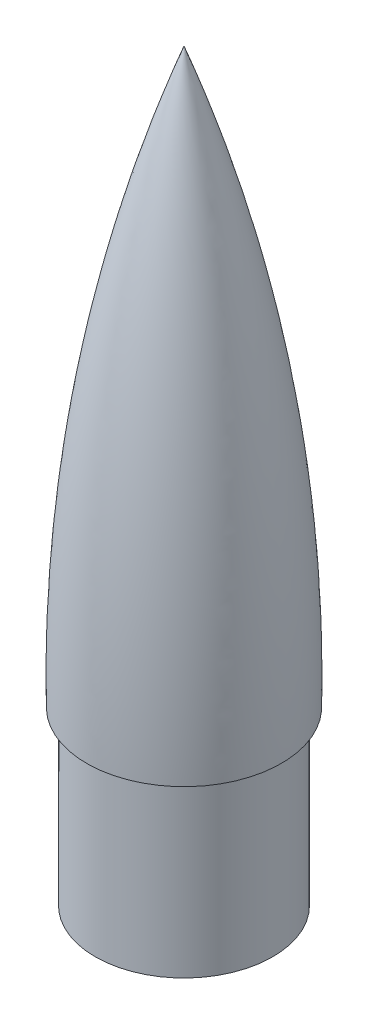
ISO-10303-21;
HEADER;
FILE_DESCRIPTION(('STEP AP214'),'2;1');
FILE_NAME('part.step','',(''),(''),'','','');
FILE_SCHEMA(('AUTOMOTIVE_DESIGN { 1 0 10303 214 1 1 1 1 }'));
ENDSEC;
DATA;
#1=APPLICATION_CONTEXT('core data for automotive mechanical design processes');
#2=APPLICATION_PROTOCOL_DEFINITION('international standard','automotive_design',2000,#1);
#3=PRODUCT_CONTEXT('',#1,'mechanical');
#4=PRODUCT('Part','Part','',(#3));
#5=PRODUCT_RELATED_PRODUCT_CATEGORY('part','',(#4));
#6=PRODUCT_DEFINITION_FORMATION('','',#4);
#7=PRODUCT_DEFINITION_CONTEXT('part definition',#1,'design');
#8=PRODUCT_DEFINITION('design','',#6,#7);
#9=PRODUCT_DEFINITION_SHAPE('','',#8);
#10=(LENGTH_UNIT() NAMED_UNIT(*) SI_UNIT(.MILLI.,.METRE.));
#11=(NAMED_UNIT(*) PLANE_ANGLE_UNIT() SI_UNIT($,.RADIAN.));
#12=(NAMED_UNIT(*) SI_UNIT($,.STERADIAN.) SOLID_ANGLE_UNIT());
#13=UNCERTAINTY_MEASURE_WITH_UNIT(LENGTH_MEASURE(1.E-05),#10,'distance_accuracy_value','');
#14=(GEOMETRIC_REPRESENTATION_CONTEXT(3) GLOBAL_UNCERTAINTY_ASSIGNED_CONTEXT((#13)) GLOBAL_UNIT_ASSIGNED_CONTEXT((#10,
#11,#12)) REPRESENTATION_CONTEXT('',''));
#15=CARTESIAN_POINT('',(0.,0.,0.));
#16=DIRECTION('',(0.,0.,1.));
#17=DIRECTION('',(1.,0.,0.));
#18=AXIS2_PLACEMENT_3D('',#15,#16,#17);
#19=CARTESIAN_POINT('',(0.,0.,0.));
#20=DIRECTION('',(0.,1.,0.));
#21=DIRECTION('',(0.,0.,1.));
#22=AXIS2_PLACEMENT_3D('',#19,#20,#21);
#23=PLANE('',#22);
#24=CARTESIAN_POINT('',(0.,0.,0.));
#25=DIRECTION('',(0.,1.,0.));
#26=DIRECTION('',(0.,0.,1.));
#27=AXIS2_PLACEMENT_3D('',#24,#25,#26);
#28=CIRCLE('',#27,15.5);
#29=CARTESIAN_POINT('',(0.,0.,15.5));
#30=VERTEX_POINT('',#29);
#31=EDGE_CURVE('E51',#30,#30,#28,.T.);
#32=ORIENTED_EDGE('',*,*,#31,.F.);
#33=EDGE_LOOP('',(#32));
#34=FACE_BOUND('',#33,.T.);
#35=CARTESIAN_POINT('',(0.,0.,0.));
#36=DIRECTION('',(0.,1.,0.));
#37=DIRECTION('',(0.,0.,1.));
#38=AXIS2_PLACEMENT_3D('',#35,#36,#37);
#39=CIRCLE('',#38,14.5);
#40=CARTESIAN_POINT('',(0.,0.,14.5));
#41=VERTEX_POINT('',#40);
#42=EDGE_CURVE('E101',#41,#41,#39,.T.);
#43=ORIENTED_EDGE('',*,*,#42,.T.);
#44=EDGE_LOOP('',(#43));
#45=FACE_BOUND('',#44,.T.);
#46=ADVANCED_FACE('F37',(#34,#45),#23,.F.);
#47=CARTESIAN_POINT('',(0.,30.,0.));
#48=DIRECTION('',(0.,-1.,0.));
#49=DIRECTION('',(0.,0.,-1.));
#50=AXIS2_PLACEMENT_3D('',#47,#48,#49);
#51=CYLINDRICAL_SURFACE('',#50,15.5);
#52=CARTESIAN_POINT('',(0.,3.3,-15.5));
#53=CARTESIAN_POINT('',(-0.0449042752623699,3.29999801891395,-15.4999997239942));
#54=CARTESIAN_POINT('',(-0.0898403483075212,3.29620656261025,-15.4998027755589));
#55=CARTESIAN_POINT('',(-0.178472732249487,3.28113553683103,-15.4990360430875));
#56=CARTESIAN_POINT('',(-0.222167521340504,3.26984715712822,-15.4984658203985));
#57=CARTESIAN_POINT('',(-0.307020594369712,3.24010646455045,-15.4970170753138));
#58=CARTESIAN_POINT('',(-0.348180163813976,3.22165781758596,-15.4961387107025));
#59=CARTESIAN_POINT('',(-0.426807194446856,3.17812594945897,-15.4941725912758));
#60=CARTESIAN_POINT('',(-0.464275521323446,3.15304428901104,-15.4930848857335));
#61=CARTESIAN_POINT('',(-0.534507566457324,3.09692864874147,-15.490821135761));
#62=CARTESIAN_POINT('',(-0.567266854744877,3.06588912740107,-15.4896450097136));
#63=CARTESIAN_POINT('',(-0.62711313599514,2.99874998409467,-15.487337678088));
#64=CARTESIAN_POINT('',(-0.654199896636211,2.9626501549819,-15.4862064743512));
#65=CARTESIAN_POINT('',(-0.701944671799145,2.88639160492156,-15.4841159636226));
#66=CARTESIAN_POINT('',(-0.722599191861546,2.84623069333867,-15.483156750188));
#67=CARTESIAN_POINT('',(-0.756870770762998,2.76300541006643,-15.4815193926693));
#68=CARTESIAN_POINT('',(-0.770487885596111,2.71994106148175,-15.4808412463489));
#69=CARTESIAN_POINT('',(-0.790286315909607,2.63217240539612,-15.4798432404336));
#70=CARTESIAN_POINT('',(-0.796474309783027,2.58746960809226,-15.4795230590647));
#71=CARTESIAN_POINT('',(-0.80125945042522,2.49765871558006,-15.4792761236371));
#72=CARTESIAN_POINT('',(-0.79985666013293,2.45255062373532,-15.4793493663162));
#73=CARTESIAN_POINT('',(-0.789505612741981,2.36325500240683,-15.4798807204727));
#74=CARTESIAN_POINT('',(-0.780564572653492,2.31906663384137,-15.4803384638331));
#75=CARTESIAN_POINT('',(-0.755402014215898,2.23281882274256,-15.4815866482603));
#76=CARTESIAN_POINT('',(-0.739180463599121,2.19075938964571,-15.4823770908015));
#77=CARTESIAN_POINT('',(-0.699909118045855,2.10994011951936,-15.4842020094838));
#78=CARTESIAN_POINT('',(-0.676856034723451,2.07118188312785,-15.4852366030989));
#79=CARTESIAN_POINT('',(-0.624578410248747,1.99808271653519,-15.4874330975801));
#80=CARTESIAN_POINT('',(-0.595353822529938,1.96374181966781,-15.4885949994068));
#81=CARTESIAN_POINT('',(-0.53152205047322,1.90041014051711,-15.4909167908476));
#82=CARTESIAN_POINT('',(-0.496908616884315,1.8714256563124,-15.4920766765243));
#83=CARTESIAN_POINT('',(-0.423303657606504,1.8196781026217,-15.4942624000891));
#84=CARTESIAN_POINT('',(-0.38431213079421,1.79691503473209,-15.4952882379428));
#85=CARTESIAN_POINT('',(-0.303054111378361,1.75825706924629,-15.4970903033857));
#86=CARTESIAN_POINT('',(-0.260787512990015,1.74236239360828,-15.4978665229081));
#87=CARTESIAN_POINT('',(-0.174180786778669,1.71789653134146,-15.4990817555668));
#88=CARTESIAN_POINT('',(-0.129840675494137,1.70932528631103,-15.4995207713922));
#89=CARTESIAN_POINT('',(-0.0404002485712565,1.69975735869128,-15.5000117739791));
#90=CARTESIAN_POINT('',(0.00469913287560576,1.69875196515422,-15.5000642058328));
#91=CARTESIAN_POINT('',(0.094425954741791,1.70432154405012,-15.4997773133914));
#92=CARTESIAN_POINT('',(0.139053396825536,1.71089648973995,-15.4994379904783));
#93=CARTESIAN_POINT('',(0.226545105968455,1.73143289831666,-15.4984060915558));
#94=CARTESIAN_POINT('',(0.26941030957934,1.74539038155772,-15.4977137058764));
#95=CARTESIAN_POINT('',(0.352189612423911,1.7802916279918,-15.4960536278545));
#96=CARTESIAN_POINT('',(0.392103693546645,1.80123543405535,-15.4950859338226));
#97=CARTESIAN_POINT('',(0.467887722131942,1.84953709563402,-15.4929829761655));
#98=CARTESIAN_POINT('',(0.503753945195229,1.87690078791262,-15.4918475604028));
#99=CARTESIAN_POINT('',(0.570386694147288,1.93725694310167,-15.4895375262628));
#100=CARTESIAN_POINT('',(0.601153185286682,1.9702494443635,-15.4883629076183));
#101=CARTESIAN_POINT('',(0.656742470503243,2.04096416773664,-15.4861055870035));
#102=CARTESIAN_POINT('',(0.681559626761376,2.07869082495514,-15.4850229728421));
#103=CARTESIAN_POINT('',(0.724507238054344,2.1577805431865,-15.4830731257882));
#104=CARTESIAN_POINT('',(0.742637723614283,2.19914358759795,-15.4822058919125));
#105=CARTESIAN_POINT('',(0.771687513191092,2.28431108264928,-15.4807852277407));
#106=CARTESIAN_POINT('',(0.782610405979214,2.32811430648612,-15.4802316412942));
#107=CARTESIAN_POINT('',(0.796946684848884,2.41693590077994,-15.4795002600012));
#108=CARTESIAN_POINT('',(0.800360117271015,2.46195426373661,-15.4793224628356));
#109=CARTESIAN_POINT('',(0.799580142191041,2.55187211883627,-15.4793627671014));
#110=CARTESIAN_POINT('',(0.795395603100788,2.59677168838399,-15.4795804069757));
#111=CARTESIAN_POINT('',(0.779556807314405,2.68522991609265,-15.480386080533));
#112=CARTESIAN_POINT('',(0.767902536454407,2.72878857171083,-15.4809741149184));
#113=CARTESIAN_POINT('',(0.73745693678844,2.81333028639914,-15.4824541974682));
#114=CARTESIAN_POINT('',(0.718665565518158,2.85431333014322,-15.4833462474414));
#115=CARTESIAN_POINT('',(0.674480662380689,2.93254344697281,-15.485333795324));
#116=CARTESIAN_POINT('',(0.649087329394521,2.96979063255248,-15.4864292871044));
#117=CARTESIAN_POINT('',(0.592387391523107,3.03953613305957,-15.4887017136426));
#118=CARTESIAN_POINT('',(0.561074565543049,3.07202938752728,-15.48987873325));
#119=CARTESIAN_POINT('',(0.493429328939067,3.13130827767203,-15.4921809390081));
#120=CARTESIAN_POINT('',(0.457095686135381,3.15809250815846,-15.4933061123443));
#121=CARTESIAN_POINT('',(0.380410190490184,3.2052063990287,-15.4953786597807));
#122=CARTESIAN_POINT('',(0.340054393783313,3.225529640749,-15.4963258566908));
#123=CARTESIAN_POINT('',(0.256528626218081,3.25908772013562,-15.4979331071516));
#124=CARTESIAN_POINT('',(0.213362043947144,3.27233092206002,-15.4985934993555));
#125=CARTESIAN_POINT('',(0.141606449590593,3.28788296500577,-15.4993782433081));
#126=CARTESIAN_POINT('',(0.113482103568098,3.29242104331927,-15.4996103760488));
#127=CARTESIAN_POINT('',(0.0569094294798187,3.29848018726219,-15.4999213417933));
#128=CARTESIAN_POINT('',(0.0284611017098812,3.3000012556464,-15.5000001749372));
#129=CARTESIAN_POINT('',(0.,3.3,-15.5));
#130=B_SPLINE_CURVE_WITH_KNOTS('',3,(#52,#53,#54,#55,#56,#57,#58,#59,#60,#61,#62,#63,#64,#65,
#66,#67,#68,#69,#70,#71,#72,#73,#74,#75,#76,#77,#78,#79,#80,#81,#82,#83,#84,#85,#86,#87,#88,#89,
#90,#91,#92,#93,#94,#95,#96,#97,#98,#99,#100,#101,#102,#103,#104,#105,#106,#107,#108,#109,#110,
#111,#112,#113,#114,#115,#116,#117,#118,#119,#120,#121,#122,#123,#124,#125,#126,#127,#128,#129),
.UNSPECIFIED.,.T.,.F.,(4,2,2,2,2,2,2,2,2,2,2,2,2,2,2,2,2,2,2,2,2,2,2,2,2,2,2,2,2,2,2,2,2,2,2,2,
2,2,4),(0.,0.134608931421981,0.269376333020869,0.404074827289342,0.538741655838066,
0.67353435288328,0.808332569361912,0.943203890764681,1.07807413902912,1.21282305496098,
1.34757085362482,1.48218979301524,1.61680932905097,1.75149377029381,1.88617922782185,
2.02102205491275,2.15586491660348,2.29071213553481,2.42555827909976,2.56024914368646,
2.6949395330907,2.82955738990399,2.96417607279451,3.09891762441979,3.23366009413111,
3.36852975067331,3.50339879151877,3.63820062822101,3.7730016330641,3.90764539825051,
4.04228941874491,4.17693424035671,4.31157500632593,4.44635806775697,4.58117426580554,
4.71612398135918,4.8509139149556,4.93623144795243,5.02154890304718),.UNSPECIFIED.);
#131=CARTESIAN_POINT('',(0.,3.3,-15.5));
#132=VERTEX_POINT('',#131);
#133=EDGE_CURVE('E120',#132,#132,#130,.T.);
#134=ORIENTED_EDGE('',*,*,#133,.T.);
#135=EDGE_LOOP('',(#134));
#136=FACE_BOUND('',#135,.T.);
#137=CARTESIAN_POINT('',(0.,30.,0.));
#138=DIRECTION('',(0.,1.,0.));
#139=DIRECTION('',(0.,0.,1.));
#140=AXIS2_PLACEMENT_3D('',#137,#138,#139);
#141=CIRCLE('',#140,15.5);
#142=CARTESIAN_POINT('',(0.,30.,15.5));
#143=VERTEX_POINT('',#142);
#144=EDGE_CURVE('E11',#143,#143,#141,.T.);
#145=ORIENTED_EDGE('',*,*,#144,.F.);
#146=EDGE_LOOP('',(#145));
#147=FACE_BOUND('',#146,.T.);
#148=ORIENTED_EDGE('',*,*,#31,.T.);
#149=EDGE_LOOP('',(#148));
#150=FACE_BOUND('',#149,.T.);
#151=ADVANCED_FACE('F39',(#136,#147,#150),#51,.T.);
#152=CARTESIAN_POINT('',(0.,30.,0.));
#153=DIRECTION('',(0.,-1.,0.));
#154=DIRECTION('',(0.,0.,-1.));
#155=AXIS2_PLACEMENT_3D('',#152,#153,#154);
#156=CYLINDRICAL_SURFACE('',#155,14.5);
#157=CARTESIAN_POINT('',(0.,3.3,-14.5));
#158=CARTESIAN_POINT('',(-0.0448997038534462,3.29999802069897,-14.4999997054633));
#159=CARTESIAN_POINT('',(-0.0898310933597828,3.29620733320394,-14.4997892176745));
#160=CARTESIAN_POINT('',(-0.178453925894953,3.28113953932199,-14.4989697758064));
#161=CARTESIAN_POINT('',(-0.222143852120782,3.26985365367248,-14.4983603544609));
#162=CARTESIAN_POINT('',(-0.306987175841121,3.24011997414036,-14.4968120084593));
#163=CARTESIAN_POINT('',(-0.34814187088615,3.22167587977017,-14.4958732540336));
#164=CARTESIAN_POINT('',(-0.426760114893581,3.17815515016863,-14.4937719130159));
#165=CARTESIAN_POINT('',(-0.464224522328655,3.15308006253218,-14.4926093786688));
#166=CARTESIAN_POINT('',(-0.534454630469344,3.09697591691933,-14.4901896572389));
#167=CARTESIAN_POINT('',(-0.567215343026485,3.06594061861212,-14.4889323717977));
#168=CARTESIAN_POINT('',(-0.627065527746397,2.99880968155813,-14.4864656962933));
#169=CARTESIAN_POINT('',(-0.65415476620816,2.96271383438666,-14.4852563082055));
#170=CARTESIAN_POINT('',(-0.701907560631343,2.88645927309085,-14.483021082221));
#171=CARTESIAN_POINT('',(-0.722567103427851,2.84629804215199,-14.4819953591298));
#172=CARTESIAN_POINT('',(-0.756848344699112,2.76307042753112,-14.4802443666613));
#173=CARTESIAN_POINT('',(-0.770470105183677,2.72000406944994,-14.4795190946369));
#174=CARTESIAN_POINT('',(-0.79027561438821,2.63223562306461,-14.478451704381));
#175=CARTESIAN_POINT('',(-0.796466994599522,2.58753526171234,-14.4781091930541));
#176=CARTESIAN_POINT('',(-0.80125954394121,2.49772849402953,-14.477844770016));
#177=CARTESIAN_POINT('',(-0.799860783047359,2.45262209144624,-14.4779228544273));
#178=CARTESIAN_POINT('',(-0.789519102046292,2.36333556774315,-14.4784904521653));
#179=CARTESIAN_POINT('',(-0.780584432067669,2.31915448778887,-14.4789795155601));
#180=CARTESIAN_POINT('',(-0.755437345076214,2.23292018345644,-14.4803132434664));
#181=CARTESIAN_POINT('',(-0.739224892327705,2.19086696952776,-14.4811579097239));
#182=CARTESIAN_POINT('',(-0.699973051289722,2.11005558146207,-14.4831081655122));
#183=CARTESIAN_POINT('',(-0.676929908948474,2.07129923435033,-14.4842138984535));
#184=CARTESIAN_POINT('',(-0.624673527490567,1.99820170909413,-14.4865615225834));
#185=CARTESIAN_POINT('',(-0.595460234834343,1.96386056926542,-14.4878034149536));
#186=CARTESIAN_POINT('',(-0.531646289266423,1.90052026619628,-14.4902853915673));
#187=CARTESIAN_POINT('',(-0.497038493771808,1.87152829827892,-14.4915254711813));
#188=CARTESIAN_POINT('',(-0.423443008257824,1.81976478097019,-14.4938624649047));
#189=CARTESIAN_POINT('',(-0.384455317000379,1.79699323333716,-14.4949593789736));
#190=CARTESIAN_POINT('',(-0.303202487620869,1.75831761541109,-14.4968864874696));
#191=CARTESIAN_POINT('',(-0.260937225781699,1.74241380450065,-14.4977166718225));
#192=CARTESIAN_POINT('',(-0.174330909206823,1.71792985375799,-14.4990166209283));
#193=CARTESIAN_POINT('',(-0.129989873380149,1.70934964722589,-14.4994863889638));
#194=CARTESIAN_POINT('',(-0.0405531386738182,1.69976535237016,-14.5000121426619));
#195=CARTESIAN_POINT('',(0.00454149079584767,1.6987513132327,-14.5000686718029));
#196=CARTESIAN_POINT('',(0.0942602425320833,1.70430215745221,-14.4997630211139));
#197=CARTESIAN_POINT('',(0.138884366698806,1.7108670101897,-14.4994008429753));
#198=CARTESIAN_POINT('',(0.226367452114782,1.7313810488445,-14.4982989124912));
#199=CARTESIAN_POINT('',(0.269227483951207,1.7453256827447,-14.4975593929084));
#200=CARTESIAN_POINT('',(0.351998750332866,1.78019882887385,-14.4957860154144));
#201=CARTESIAN_POINT('',(0.391909964189538,1.80112739009553,-14.4947521554384));
#202=CARTESIAN_POINT('',(0.467696305560378,1.84939972644331,-14.4925049943357));
#203=CARTESIAN_POINT('',(0.503567184777285,1.87675016251063,-14.4912915073813));
#204=CARTESIAN_POINT('',(0.570211879204188,1.9370801524293,-14.4888223385494));
#205=CARTESIAN_POINT('',(0.600985654967705,1.97005974984072,-14.4875666563453));
#206=CARTESIAN_POINT('',(0.656596169755032,2.04075474863939,-14.4851530634213));
#207=CARTESIAN_POINT('',(0.68142646383324,2.07847522393654,-14.4839952597098));
#208=CARTESIAN_POINT('',(0.724401112326177,2.15755564965193,-14.4819096774477));
#209=CARTESIAN_POINT('',(0.742545500554872,2.1989155816623,-14.4809818977337));
#210=CARTESIAN_POINT('',(0.77162207649522,2.28407711734579,-14.4794617547202));
#211=CARTESIAN_POINT('',(0.782558352600656,2.32787732159548,-14.4788692013097));
#212=CARTESIAN_POINT('',(0.796921627727084,2.41669560124858,-14.4780858008144));
#213=CARTESIAN_POINT('',(0.800348681693757,2.46171366773834,-14.4778949507904));
#214=CARTESIAN_POINT('',(0.799595712981105,2.55162565306808,-14.4779365505523));
#215=CARTESIAN_POINT('',(0.795425826280096,2.59651965740577,-14.4781684363167));
#216=CARTESIAN_POINT('',(0.779618321175355,2.68496912312796,-14.4790281810411));
#217=CARTESIAN_POINT('',(0.767980688788813,2.728524582006,-14.4796560407425));
#218=CARTESIAN_POINT('',(0.737570205470823,2.81306244220543,-14.4812368409486));
#219=CARTESIAN_POINT('',(0.718797337268114,2.85404483729831,-14.4821897822403));
#220=CARTESIAN_POINT('',(0.674650851319805,2.9322770724326,-14.4843133230569));
#221=CARTESIAN_POINT('',(0.649277423869131,2.96952702003805,-14.4854839163065));
#222=CARTESIAN_POINT('',(0.59261318850794,3.03928798289147,-14.4879126347118));
#223=CARTESIAN_POINT('',(0.561315185021912,3.0717931495379,-14.4891708651184));
#224=CARTESIAN_POINT('',(0.493697434601601,3.13109852156186,-14.4916322357494));
#225=CARTESIAN_POINT('',(0.457376456794643,3.15789732450259,-14.4928353623743));
#226=CARTESIAN_POINT('',(0.380710328471624,3.20504454678637,-14.4950519449123));
#227=CARTESIAN_POINT('',(0.340360931920076,3.22538606362208,-14.4960651973891));
#228=CARTESIAN_POINT('',(0.256843851371727,3.25898129481083,-14.4977849516382));
#229=CARTESIAN_POINT('',(0.213679552925298,3.27224335360153,-14.4984918143612));
#230=CARTESIAN_POINT('',(0.141873872318395,3.2878368097071,-14.4993328445982));
#231=CARTESIAN_POINT('',(0.113697228841664,3.29239215397227,-14.4995819235997));
#232=CARTESIAN_POINT('',(0.0570179833793408,3.29847437604096,-14.4999155947427));
#233=CARTESIAN_POINT('',(0.0285153817372424,3.30000125703556,-14.5000001870575));
#234=CARTESIAN_POINT('',(0.,3.3,-14.5));
#235=B_SPLINE_CURVE_WITH_KNOTS('',3,(#157,#158,#159,#160,#161,#162,#163,#164,#165,#166,#167,
#168,#169,#170,#171,#172,#173,#174,#175,#176,#177,#178,#179,#180,#181,#182,#183,#184,#185,#186,
#187,#188,#189,#190,#191,#192,#193,#194,#195,#196,#197,#198,#199,#200,#201,#202,#203,#204,#205,
#206,#207,#208,#209,#210,#211,#212,#213,#214,#215,#216,#217,#218,#219,#220,#221,#222,#223,#224,
#225,#226,#227,#228,#229,#230,#231,#232,#233,#234),.UNSPECIFIED.,.T.,.F.,(4,2,2,2,2,2,2,2,2,2,2,
2,2,2,2,2,2,2,2,2,2,2,2,2,2,2,2,2,2,2,2,2,2,2,2,2,2,2,4),(0.,0.134595017361878,
0.269347967040087,0.404031366109799,0.538683359376992,0.673477109328624,0.808276412552216,
0.943159684276413,1.07804176752551,1.21278519908282,1.34752738840239,1.48212225645628,
1.61671778541079,1.75138742377121,1.88605823073364,2.02090888718436,2.15575958175378,
2.29061536895676,2.42546992794494,2.56014709863816,2.69482372522422,2.82941737685649,
2.96401197269238,3.09874679522246,3.23348266041649,3.36836397416962,3.50324460575123,
3.63804866793932,3.77285174375019,3.9074750945107,4.04209869734434,4.17672262604446,
4.31134267395039,4.44612728333825,4.58094498022078,4.71590630876897,4.85070820745096,
4.93618833348155,5.02166836944197),.UNSPECIFIED.);
#236=CARTESIAN_POINT('',(0.,3.3,-14.5));
#237=VERTEX_POINT('',#236);
#238=EDGE_CURVE('E42',#237,#237,#235,.T.);
#239=ORIENTED_EDGE('',*,*,#238,.F.);
#240=EDGE_LOOP('',(#239));
#241=FACE_BOUND('',#240,.T.);
#242=CARTESIAN_POINT('',(0.,30.,0.));
#243=DIRECTION('',(0.,1.,0.));
#244=DIRECTION('',(0.,0.,1.));
#245=AXIS2_PLACEMENT_3D('',#242,#243,#244);
#246=CIRCLE('',#245,14.5);
#247=CARTESIAN_POINT('',(0.,30.,14.5));
#248=VERTEX_POINT('',#247);
#249=EDGE_CURVE('E102',#248,#248,#246,.T.);
#250=ORIENTED_EDGE('',*,*,#249,.T.);
#251=EDGE_LOOP('',(#250));
#252=FACE_BOUND('',#251,.T.);
#253=ORIENTED_EDGE('',*,*,#42,.F.);
#254=EDGE_LOOP('',(#253));
#255=FACE_BOUND('',#254,.T.);
#256=ADVANCED_FACE('F82',(#241,#252,#255),#156,.F.);
#257=CARTESIAN_POINT('',(0.,30.,0.));
#258=DIRECTION('',(0.,-1.,0.));
#259=DIRECTION('',(1.,0.,0.));
#260=AXIS2_PLACEMENT_3D('',#257,#258,#259);
#261=PLANE('',#260);
#262=ORIENTED_EDGE('',*,*,#144,.T.);
#263=EDGE_LOOP('',(#262));
#264=FACE_BOUND('',#263,.T.);
#265=CARTESIAN_POINT('',(0.,30.0000000000001,0.));
#266=DIRECTION('',(0.,1.,0.));
#267=DIRECTION('',(-1.,0.,0.));
#268=AXIS2_PLACEMENT_3D('',#265,#266,#267);
#269=CIRCLE('',#268,17.);
#270=CARTESIAN_POINT('',(-17.,30.0000000000001,0.));
#271=VERTEX_POINT('',#270);
#272=EDGE_CURVE('E99',#271,#271,#269,.T.);
#273=ORIENTED_EDGE('',*,*,#272,.F.);
#274=EDGE_LOOP('',(#273));
#275=FACE_BOUND('',#274,.T.);
#276=ADVANCED_FACE('F89',(#264,#275),#261,.T.);
#277=CARTESIAN_POINT('',(257.530184914814,34.7748685644817,0.));
#278=DIRECTION('',(0.,0.,-1.));
#279=DIRECTION('',(-1.,0.,0.));
#280=AXIS2_PLACEMENT_3D('',#277,#278,#279);
#281=CIRCLE('',#280,274.571706115488);
#282=TRIMMED_CURVE('',#281,(PARAMETER_VALUE(-0.354171433483975)),
(PARAMETER_VALUE(0.354171433483975)),.T.,.PARAMETER.);
#283=CARTESIAN_POINT('',(0.,34.7748685644816,0.));
#284=DIRECTION('',(0.,1.,0.));
#285=AXIS1_PLACEMENT('',#283,#284);
#286=SURFACE_OF_REVOLUTION('',#282,#285);
#287=ORIENTED_EDGE('',*,*,#272,.T.);
#288=EDGE_LOOP('',(#287));
#289=FACE_BOUND('',#288,.T.);
#290=CARTESIAN_POINT('',(0.,130.,0.));
#291=VERTEX_POINT('',#290);
#292=VERTEX_LOOP('',#291);
#293=FACE_BOUND('',#292,.T.);
#294=ADVANCED_FACE('F71',(#289,#293),#286,.T.);
#295=CARTESIAN_POINT('',(0.,30.,0.));
#296=DIRECTION('',(0.,-1.,0.));
#297=DIRECTION('',(0.,0.,-1.));
#298=AXIS2_PLACEMENT_3D('',#295,#296,#297);
#299=PLANE('',#298);
#300=CARTESIAN_POINT('',(0.,30.,0.));
#301=DIRECTION('',(0.,1.,0.));
#302=DIRECTION('',(0.,0.,1.));
#303=AXIS2_PLACEMENT_3D('',#300,#301,#302);
#304=CIRCLE('',#303,15.);
#305=CARTESIAN_POINT('',(0.,30.,15.));
#306=VERTEX_POINT('',#305);
#307=EDGE_CURVE('E107',#306,#306,#304,.T.);
#308=ORIENTED_EDGE('',*,*,#307,.T.);
#309=EDGE_LOOP('',(#308));
#310=FACE_BOUND('',#309,.T.);
#311=ORIENTED_EDGE('',*,*,#249,.F.);
#312=EDGE_LOOP('',(#311));
#313=FACE_BOUND('',#312,.T.);
#314=ADVANCED_FACE('F61',(#310,#313),#299,.F.);
#315=CARTESIAN_POINT('',(0.,127.5,0.));
#316=CARTESIAN_POINT('',(-1.28526032597787,123.677634700507,0.));
#317=CARTESIAN_POINT('',(-2.14377888479964,120.771879578341,0.));
#318=CARTESIAN_POINT('',(-5.63760707653449,103.809110263735,0.));
#319=B_SPLINE_CURVE_WITH_KNOTS('',3,(#315,#316,#317,#318),.UNSPECIFIED.,.F.,.F.,(4,4),(0.,1.),.UNSPECIFIED.);
#320=CARTESIAN_POINT('',(0.,127.5,0.));
#321=DIRECTION('',(0.,1.,0.));
#322=AXIS1_PLACEMENT('',#320,#321);
#323=SURFACE_OF_REVOLUTION('',#319,#322);
#324=CARTESIAN_POINT('',(0.,103.809110263735,0.));
#325=DIRECTION('',(0.,1.,0.));
#326=DIRECTION('',(0.,0.,1.));
#327=AXIS2_PLACEMENT_3D('',#324,#325,#326);
#328=CIRCLE('',#327,5.63760707653454);
#329=CARTESIAN_POINT('',(0.,103.809110263735,5.63760707653454));
#330=VERTEX_POINT('',#329);
#331=EDGE_CURVE('E117',#330,#330,#328,.T.);
#332=ORIENTED_EDGE('',*,*,#331,.F.);
#333=EDGE_LOOP('',(#332));
#334=FACE_BOUND('',#333,.T.);
#335=CARTESIAN_POINT('',(0.,127.5,0.));
#336=VERTEX_POINT('',#335);
#337=VERTEX_LOOP('',#336);
#338=FACE_BOUND('',#337,.T.);
#339=ADVANCED_FACE('F58',(#334,#338),#323,.T.);
#340=CARTESIAN_POINT('',(-14.4536308700824,41.689868179824,0.));
#341=CARTESIAN_POINT('',(-14.564513424437,36.7097599604212,0.));
#342=CARTESIAN_POINT('',(-15.,30.,0.));
#343=B_SPLINE_CURVE_WITH_KNOTS('',2,(#340,#341,#342),.UNSPECIFIED.,.F.,.F.,(3,3),(0.,1.),.UNSPECIFIED.);
#344=CARTESIAN_POINT('',(0.,127.5,0.));
#345=DIRECTION('',(0.,1.,0.));
#346=AXIS1_PLACEMENT('',#344,#345);
#347=SURFACE_OF_REVOLUTION('',#343,#346);
#348=ORIENTED_EDGE('',*,*,#307,.F.);
#349=EDGE_LOOP('',(#348));
#350=FACE_BOUND('',#349,.T.);
#351=CARTESIAN_POINT('',(0.,41.689868179824,0.));
#352=DIRECTION('',(0.,1.,0.));
#353=DIRECTION('',(0.,0.,1.));
#354=AXIS2_PLACEMENT_3D('',#351,#352,#353);
#355=CIRCLE('',#354,14.4536308700824);
#356=CARTESIAN_POINT('',(0.,41.689868179824,14.4536308700824));
#357=VERTEX_POINT('',#356);
#358=EDGE_CURVE('E114',#357,#357,#355,.T.);
#359=ORIENTED_EDGE('',*,*,#358,.T.);
#360=EDGE_LOOP('',(#359));
#361=FACE_BOUND('',#360,.T.);
#362=ADVANCED_FACE('F60',(#350,#361),#347,.T.);
#363=CARTESIAN_POINT('',(0.,34.7748685644817,0.));
#364=DIRECTION('',(0.,1.,0.));
#365=DIRECTION('',(0.,0.,1.));
#366=AXIS2_PLACEMENT_3D('',#363,#364,#365);
#367=DEGENERATE_TOROIDAL_SURFACE('',#366,257.530184914814,272.071706115488,.F.);
#368=ORIENTED_EDGE('',*,*,#358,.F.);
#369=EDGE_LOOP('',(#368));
#370=FACE_BOUND('',#369,.T.);
#371=ORIENTED_EDGE('',*,*,#331,.T.);
#372=EDGE_LOOP('',(#371));
#373=FACE_BOUND('',#372,.T.);
#374=ADVANCED_FACE('F68',(#370,#373),#367,.T.);
#375=CARTESIAN_POINT('',(0.,2.5,-17.0415212006743));
#376=DIRECTION('',(0.,0.,1.));
#377=DIRECTION('',(1.,0.,0.));
#378=AXIS2_PLACEMENT_3D('',#375,#376,#377);
#379=CYLINDRICAL_SURFACE('',#378,0.8);
#380=ORIENTED_EDGE('',*,*,#238,.T.);
#381=EDGE_LOOP('',(#380));
#382=FACE_BOUND('',#381,.T.);
#383=ORIENTED_EDGE('',*,*,#133,.F.);
#384=EDGE_LOOP('',(#383));
#385=FACE_BOUND('',#384,.T.);
#386=ADVANCED_FACE('F133',(#382,#385),#379,.F.);
#387=CLOSED_SHELL('',(#46,#151,#256,#276,#294,#314,#339,#362,#374,#386));
#388=MANIFOLD_SOLID_BREP('B2',#387);
#389=ADVANCED_BREP_SHAPE_REPRESENTATION('',(#18,#388),#14);
#390=SHAPE_DEFINITION_REPRESENTATION(#9,#389);
ENDSEC;
END-ISO-10303-21;
